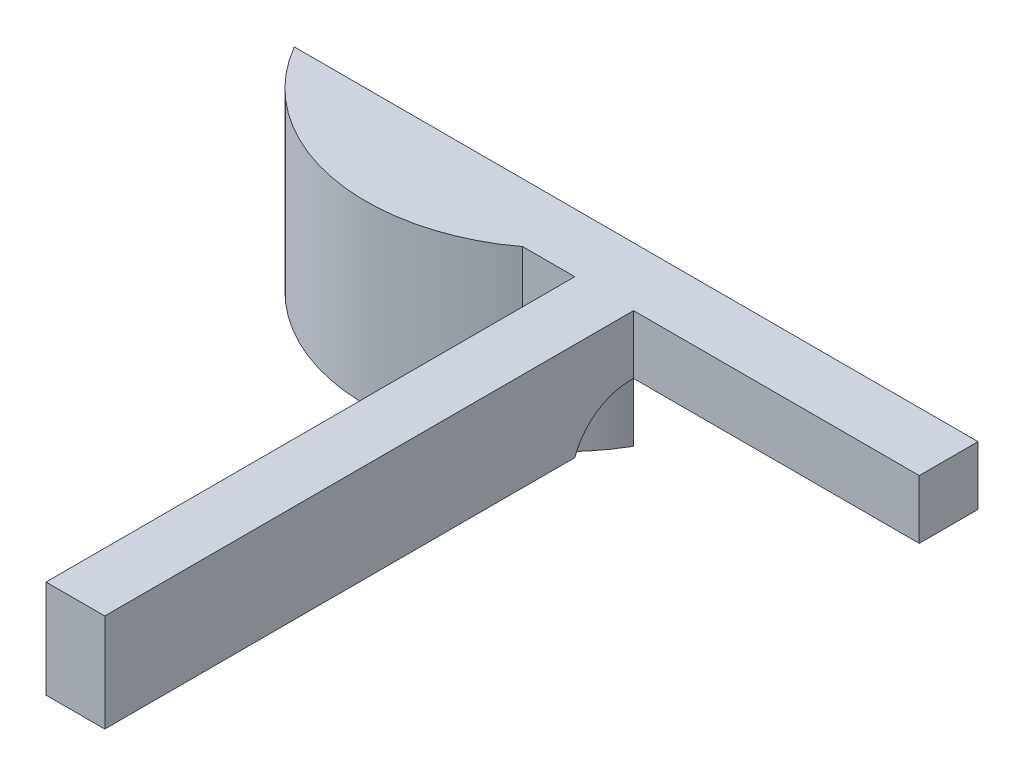
ISO-10303-21;
HEADER;
FILE_DESCRIPTION(('STEP AP214'),'2;1');
FILE_NAME('part.step','',(''),(''),'','','');
FILE_SCHEMA(('AUTOMOTIVE_DESIGN { 1 0 10303 214 1 1 1 1 }'));
ENDSEC;
DATA;
#1=APPLICATION_CONTEXT('core data for automotive mechanical design processes');
#2=APPLICATION_PROTOCOL_DEFINITION('international standard','automotive_design',2000,#1);
#3=PRODUCT_CONTEXT('',#1,'mechanical');
#4=PRODUCT('Part','Part','',(#3));
#5=PRODUCT_RELATED_PRODUCT_CATEGORY('part','',(#4));
#6=PRODUCT_DEFINITION_FORMATION('','',#4);
#7=PRODUCT_DEFINITION_CONTEXT('part definition',#1,'design');
#8=PRODUCT_DEFINITION('design','',#6,#7);
#9=PRODUCT_DEFINITION_SHAPE('','',#8);
#10=(LENGTH_UNIT() NAMED_UNIT(*) SI_UNIT(.MILLI.,.METRE.));
#11=(NAMED_UNIT(*) PLANE_ANGLE_UNIT() SI_UNIT($,.RADIAN.));
#12=(NAMED_UNIT(*) SI_UNIT($,.STERADIAN.) SOLID_ANGLE_UNIT());
#13=UNCERTAINTY_MEASURE_WITH_UNIT(LENGTH_MEASURE(1.E-05),#10,'distance_accuracy_value','');
#14=(GEOMETRIC_REPRESENTATION_CONTEXT(3) GLOBAL_UNCERTAINTY_ASSIGNED_CONTEXT((#13)) GLOBAL_UNIT_ASSIGNED_CONTEXT((#10,
#11,#12)) REPRESENTATION_CONTEXT('',''));
#15=CARTESIAN_POINT('',(0.,0.,0.));
#16=DIRECTION('',(0.,0.,1.));
#17=DIRECTION('',(1.,0.,0.));
#18=AXIS2_PLACEMENT_3D('',#15,#16,#17);
#19=CARTESIAN_POINT('',(0.,0.,0.));
#20=DIRECTION('',(0.,1.,0.));
#21=DIRECTION('',(0.,0.,1.));
#22=AXIS2_PLACEMENT_3D('',#19,#20,#21);
#23=PLANE('',#22);
#24=DIRECTION('',(0.,0.,-1.));
#25=VECTOR('',#24,1.);
#26=CARTESIAN_POINT('',(11.6602540378444,0.,35.));
#27=LINE('',#26,#25);
#28=CARTESIAN_POINT('',(11.6602540378444,0.,8.17060373191174));
#29=VERTEX_POINT('',#28);
#30=CARTESIAN_POINT('',(11.6602540378444,0.,8.));
#31=VERTEX_POINT('',#30);
#32=EDGE_CURVE('E229',#29,#31,#27,.T.);
#33=ORIENTED_EDGE('',*,*,#32,.F.);
#34=DIRECTION('',(1.,0.,0.));
#35=VECTOR('',#34,1.);
#36=CARTESIAN_POINT('',(0.,0.,8.17060373191174));
#37=LINE('',#36,#35);
#38=CARTESIAN_POINT('',(8.66025403784439,0.,8.17060373191174));
#39=VERTEX_POINT('',#38);
#40=EDGE_CURVE('E150',#29,#39,#37,.F.);
#41=ORIENTED_EDGE('',*,*,#40,.T.);
#42=DIRECTION('',(0.,0.,-1.));
#43=VECTOR('',#42,1.);
#44=CARTESIAN_POINT('',(8.66025403784439,0.,35.));
#45=LINE('',#44,#43);
#46=CARTESIAN_POINT('',(8.66025403784439,0.,8.));
#47=VERTEX_POINT('',#46);
#48=EDGE_CURVE('E246',#39,#47,#45,.T.);
#49=ORIENTED_EDGE('',*,*,#48,.T.);
#50=DIRECTION('',(1.,0.,0.));
#51=VECTOR('',#50,1.);
#52=CARTESIAN_POINT('',(0.,0.,8.));
#53=LINE('',#52,#51);
#54=CARTESIAN_POINT('',(7.54983443527075,0.,8.));
#55=VERTEX_POINT('',#54);
#56=EDGE_CURVE('E284',#55,#47,#53,.T.);
#57=ORIENTED_EDGE('',*,*,#56,.F.);
#58=CARTESIAN_POINT('',(0.,0.,0.));
#59=DIRECTION('',(0.,1.,0.));
#60=DIRECTION('',(0.,0.,1.));
#61=AXIS2_PLACEMENT_3D('',#58,#59,#60);
#62=CIRCLE('',#61,11.);
#63=CARTESIAN_POINT('',(9.79795897113271,0.,5.));
#64=VERTEX_POINT('',#63);
#65=EDGE_CURVE('E300',#55,#64,#62,.T.);
#66=ORIENTED_EDGE('',*,*,#65,.T.);
#67=DIRECTION('',(1.,0.,0.));
#68=VECTOR('',#67,1.);
#69=CARTESIAN_POINT('',(0.,0.,5.));
#70=LINE('',#69,#68);
#71=CARTESIAN_POINT('',(26.2449979983984,0.,5.));
#72=VERTEX_POINT('',#71);
#73=EDGE_CURVE('E268',#64,#72,#70,.T.);
#74=ORIENTED_EDGE('',*,*,#73,.T.);
#75=DIRECTION('',(0.,0.,-1.));
#76=VECTOR('',#75,1.);
#77=CARTESIAN_POINT('',(26.2449979983984,0.,0.));
#78=LINE('',#77,#76);
#79=CARTESIAN_POINT('',(26.2449979983984,0.,8.));
#80=VERTEX_POINT('',#79);
#81=EDGE_CURVE('E272',#80,#72,#78,.T.);
#82=ORIENTED_EDGE('',*,*,#81,.F.);
#83=EDGE_CURVE('E231',#31,#80,#53,.T.);
#84=ORIENTED_EDGE('',*,*,#83,.F.);
#85=EDGE_LOOP('',(#33,#41,#49,#57,#66,#74,#82,#84));
#86=FACE_BOUND('',#85,.T.);
#87=ADVANCED_FACE('F37',(#86),#23,.F.);
#88=CARTESIAN_POINT('',(0.,3.,8.));
#89=DIRECTION('',(0.,0.,-1.));
#90=DIRECTION('',(-1.,0.,0.));
#91=AXIS2_PLACEMENT_3D('',#88,#89,#90);
#92=PLANE('',#91);
#93=DIRECTION('',(1.,0.,0.));
#94=VECTOR('',#93,1.);
#95=CARTESIAN_POINT('',(0.,3.,8.));
#96=LINE('',#95,#94);
#97=CARTESIAN_POINT('',(11.6602540378444,3.,8.));
#98=VERTEX_POINT('',#97);
#99=CARTESIAN_POINT('',(26.2449979983984,3.,8.));
#100=VERTEX_POINT('',#99);
#101=EDGE_CURVE('E274',#98,#100,#96,.T.);
#102=ORIENTED_EDGE('',*,*,#101,.F.);
#103=DIRECTION('',(0.,-1.,0.));
#104=VECTOR('',#103,1.);
#105=CARTESIAN_POINT('',(11.6602540378444,3.,8.));
#106=LINE('',#105,#104);
#107=EDGE_CURVE('E237',#98,#31,#106,.T.);
#108=ORIENTED_EDGE('',*,*,#107,.T.);
#109=ORIENTED_EDGE('',*,*,#83,.T.);
#110=DIRECTION('',(0.,-1.,0.));
#111=VECTOR('',#110,1.);
#112=CARTESIAN_POINT('',(26.2449979983984,3.,8.));
#113=LINE('',#112,#111);
#114=EDGE_CURVE('E291',#100,#80,#113,.T.);
#115=ORIENTED_EDGE('',*,*,#114,.F.);
#116=EDGE_LOOP('',(#102,#108,#109,#115));
#117=FACE_BOUND('',#116,.T.);
#118=ADVANCED_FACE('F176',(#117),#92,.F.);
#119=CARTESIAN_POINT('',(0.,3.,5.));
#120=DIRECTION('',(0.,0.,-1.));
#121=DIRECTION('',(-1.,0.,0.));
#122=AXIS2_PLACEMENT_3D('',#119,#120,#121);
#123=PLANE('',#122);
#124=DIRECTION('',(1.,0.,0.));
#125=VECTOR('',#124,1.);
#126=CARTESIAN_POINT('',(0.,3.,5.));
#127=LINE('',#126,#125);
#128=CARTESIAN_POINT('',(-8.66025403784439,3.,5.));
#129=VERTEX_POINT('',#128);
#130=CARTESIAN_POINT('',(26.2449979983984,3.,5.));
#131=VERTEX_POINT('',#130);
#132=EDGE_CURVE('E269',#129,#131,#127,.T.);
#133=ORIENTED_EDGE('',*,*,#132,.T.);
#134=DIRECTION('',(0.,-1.,0.));
#135=VECTOR('',#134,1.);
#136=CARTESIAN_POINT('',(26.2449979983984,3.,5.));
#137=LINE('',#136,#135);
#138=EDGE_CURVE('E281',#131,#72,#137,.T.);
#139=ORIENTED_EDGE('',*,*,#138,.T.);
#140=ORIENTED_EDGE('',*,*,#73,.F.);
#141=CARTESIAN_POINT('',(9.79795897113271,0.,5.));
#142=CARTESIAN_POINT('',(9.72761682336962,1.10900954037672E-05,5.));
#143=CARTESIAN_POINT('',(9.65726465432284,-0.00588944403521871,5.));
#144=CARTESIAN_POINT('',(9.51832199870247,-0.029306070305392,5.));
#145=CARTESIAN_POINT('',(9.44973694478982,-0.0468543622165424,5.));
#146=CARTESIAN_POINT('',(9.31644513878141,-0.0933833926634255,5.));
#147=CARTESIAN_POINT('',(9.25174300025859,-0.122377432574764,5.));
#148=CARTESIAN_POINT('',(9.12854435340301,-0.191409865683067,5.));
#149=CARTESIAN_POINT('',(9.07004220803306,-0.231438105219946,5.));
#150=CARTESIAN_POINT('',(8.96470921988117,-0.319371859029543,5.));
#151=CARTESIAN_POINT('',(8.91740857349411,-0.366711505254911,5.));
#152=CARTESIAN_POINT('',(8.83286296179348,-0.469712138101888,5.));
#153=CARTESIAN_POINT('',(8.7956117236189,-0.525367899913306,5.));
#154=CARTESIAN_POINT('',(8.73760048523063,-0.635595652855344,5.));
#155=CARTESIAN_POINT('',(8.71532902210621,-0.689373539127373,5.));
#156=CARTESIAN_POINT('',(8.68162623541311,-0.800157472437469,5.));
#157=CARTESIAN_POINT('',(8.67016306938351,-0.857153509238941,5.));
#158=CARTESIAN_POINT('',(8.66306490404357,-0.928805889440061,5.));
#159=CARTESIAN_POINT('',(8.66201077469414,-0.943034000858278,5.));
#160=CARTESIAN_POINT('',(8.66060655289219,-0.971505826904159,5.));
#161=CARTESIAN_POINT('',(8.66025551830919,-0.985749495028477,5.));
#162=CARTESIAN_POINT('',(8.66025403784439,-1.,5.));
#163=B_SPLINE_CURVE_WITH_KNOTS('',3,(#141,#142,#143,#144,#145,#146,#147,#148,#149,#150,#151,
#152,#153,#154,#155,#156,#157,#158,#159,#160,#161,#162),.UNSPECIFIED.,.F.,.F.,(4,2,2,2,2,2,2,2,
2,2,4),(0.,0.210803800365691,0.422192800327881,0.633828187094118,0.845269473557663,
1.04488352876159,1.24437269464493,1.41801167636839,1.59113748479491,1.63392840147859,
1.67666194087572),.UNSPECIFIED.);
#164=CARTESIAN_POINT('',(8.66025403784439,-1.,5.));
#165=VERTEX_POINT('',#164);
#166=EDGE_CURVE('E153',#64,#165,#163,.T.);
#167=ORIENTED_EDGE('',*,*,#166,.T.);
#168=DIRECTION('',(0.,1.,0.));
#169=VECTOR('',#168,1.);
#170=CARTESIAN_POINT('',(8.66025403784439,-6.,5.));
#171=LINE('',#170,#169);
#172=CARTESIAN_POINT('',(8.66025403784439,-6.,5.));
#173=VERTEX_POINT('',#172);
#174=EDGE_CURVE('E263',#173,#165,#171,.T.);
#175=ORIENTED_EDGE('',*,*,#174,.F.);
#176=DIRECTION('',(1.,0.,0.));
#177=VECTOR('',#176,1.);
#178=CARTESIAN_POINT('',(0.,-6.,5.));
#179=LINE('',#178,#177);
#180=CARTESIAN_POINT('',(6.2449979983984,-6.,5.));
#181=VERTEX_POINT('',#180);
#182=EDGE_CURVE('E253',#181,#173,#179,.T.);
#183=ORIENTED_EDGE('',*,*,#182,.F.);
#184=DIRECTION('',(0.,1.,0.));
#185=VECTOR('',#184,1.);
#186=CARTESIAN_POINT('',(6.2449979983984,-6.,5.));
#187=LINE('',#186,#185);
#188=CARTESIAN_POINT('',(6.2449979983984,0.,5.));
#189=VERTEX_POINT('',#188);
#190=EDGE_CURVE('E266',#181,#189,#187,.T.);
#191=ORIENTED_EDGE('',*,*,#190,.T.);
#192=CARTESIAN_POINT('',(-6.2449979983984,0.,5.));
#193=VERTEX_POINT('',#192);
#194=EDGE_CURVE('E283',#193,#189,#70,.T.);
#195=ORIENTED_EDGE('',*,*,#194,.F.);
#196=DIRECTION('',(0.,1.,0.));
#197=VECTOR('',#196,1.);
#198=CARTESIAN_POINT('',(-6.2449979983984,-6.,5.));
#199=LINE('',#198,#197);
#200=CARTESIAN_POINT('',(-6.2449979983984,-6.,5.));
#201=VERTEX_POINT('',#200);
#202=EDGE_CURVE('E261',#201,#193,#199,.T.);
#203=ORIENTED_EDGE('',*,*,#202,.F.);
#204=CARTESIAN_POINT('',(-8.66025403784439,-6.,5.));
#205=VERTEX_POINT('',#204);
#206=EDGE_CURVE('E256',#205,#201,#179,.T.);
#207=ORIENTED_EDGE('',*,*,#206,.F.);
#208=DIRECTION('',(0.,-1.,0.));
#209=VECTOR('',#208,1.);
#210=CARTESIAN_POINT('',(-8.66025403784439,3.,5.));
#211=LINE('',#210,#209);
#212=EDGE_CURVE('E296',#129,#205,#211,.T.);
#213=ORIENTED_EDGE('',*,*,#212,.F.);
#214=EDGE_LOOP('',(#133,#139,#140,#167,#175,#183,#191,#195,#203,#207,#213));
#215=FACE_BOUND('',#214,.T.);
#216=ADVANCED_FACE('F171',(#215),#123,.T.);
#217=CARTESIAN_POINT('',(0.,3.,0.));
#218=DIRECTION('',(0.,-1.,0.));
#219=DIRECTION('',(0.,0.,-1.));
#220=AXIS2_PLACEMENT_3D('',#217,#218,#219);
#221=CYLINDRICAL_SURFACE('',#220,10.);
#222=ORIENTED_EDGE('',*,*,#174,.T.);
#223=CARTESIAN_POINT('',(0.,-1.,0.));
#224=DIRECTION('',(0.,1.,0.));
#225=DIRECTION('',(0.,0.,1.));
#226=AXIS2_PLACEMENT_3D('',#223,#224,#225);
#227=CIRCLE('',#226,10.);
#228=CARTESIAN_POINT('',(6.,-1.,8.));
#229=VERTEX_POINT('',#228);
#230=EDGE_CURVE('E298',#165,#229,#227,.F.);
#231=ORIENTED_EDGE('',*,*,#230,.T.);
#232=DIRECTION('',(0.,-1.,0.));
#233=VECTOR('',#232,1.);
#234=CARTESIAN_POINT('',(6.,3.,8.));
#235=LINE('',#234,#233);
#236=CARTESIAN_POINT('',(6.,3.,8.));
#237=VERTEX_POINT('',#236);
#238=EDGE_CURVE('E294',#237,#229,#235,.T.);
#239=ORIENTED_EDGE('',*,*,#238,.F.);
#240=CARTESIAN_POINT('',(0.,3.,0.));
#241=DIRECTION('',(0.,1.,0.));
#242=DIRECTION('',(0.,0.,1.));
#243=AXIS2_PLACEMENT_3D('',#240,#241,#242);
#244=CIRCLE('',#243,10.);
#245=EDGE_CURVE('E271',#129,#237,#244,.T.);
#246=ORIENTED_EDGE('',*,*,#245,.F.);
#247=ORIENTED_EDGE('',*,*,#212,.T.);
#248=CARTESIAN_POINT('',(0.,-6.,0.));
#249=DIRECTION('',(0.,-1.,0.));
#250=DIRECTION('',(0.,0.,-1.));
#251=AXIS2_PLACEMENT_3D('',#248,#249,#250);
#252=CIRCLE('',#251,10.);
#253=EDGE_CURVE('E255',#173,#205,#252,.T.);
#254=ORIENTED_EDGE('',*,*,#253,.F.);
#255=EDGE_LOOP('',(#222,#231,#239,#246,#247,#254));
#256=FACE_BOUND('',#255,.T.);
#257=ADVANCED_FACE('F175',(#256),#221,.T.);
#258=ORIENTED_EDGE('',*,*,#238,.T.);
#259=CARTESIAN_POINT('',(6.,-1.,8.));
#260=CARTESIAN_POINT('',(5.99999238106717,-0.979160469243082,8.));
#261=CARTESIAN_POINT('',(6.00108672592669,-0.958336985268452,8.));
#262=CARTESIAN_POINT('',(6.00540005287894,-0.916940070153584,8.));
#263=CARTESIAN_POINT('',(6.00861602595151,-0.896366326839907,8.));
#264=CARTESIAN_POINT('',(6.02121836424117,-0.835805930352294,8.));
#265=CARTESIAN_POINT('',(6.03356386132602,-0.796409380249933,8.));
#266=CARTESIAN_POINT('',(6.0648165995812,-0.720653688780115,8.));
#267=CARTESIAN_POINT('',(6.0836891807754,-0.684279737660445,8.));
#268=CARTESIAN_POINT('',(6.12664759807124,-0.614637567403576,8.));
#269=CARTESIAN_POINT('',(6.15075161139671,-0.58138077110921,8.));
#270=CARTESIAN_POINT('',(6.21832379965506,-0.499470084406747,8.));
#271=CARTESIAN_POINT('',(6.26481955912311,-0.453326086306723,8.));
#272=CARTESIAN_POINT('',(6.36432517664136,-0.368718068029987,8.));
#273=CARTESIAN_POINT('',(6.41735031535169,-0.330272638394648,8.));
#274=CARTESIAN_POINT('',(6.51512660974024,-0.268357463724322,8.));
#275=CARTESIAN_POINT('',(6.55899837690561,-0.243473330110714,8.));
#276=CARTESIAN_POINT('',(6.64872932260632,-0.197566411760472,8.));
#277=CARTESIAN_POINT('',(6.69458957385705,-0.176545744077271,8.));
#278=CARTESIAN_POINT('',(6.83450613394771,-0.118924001853227,8.));
#279=CARTESIAN_POINT('',(6.93085434572936,-0.0877898724868191,8.));
#280=CARTESIAN_POINT('',(7.11428090119226,-0.0424413237714773,8.));
#281=CARTESIAN_POINT('',(7.20096309016768,-0.0265688893099719,8.));
#282=CARTESIAN_POINT('',(7.33164284713813,-0.0106639341115777,8.));
#283=CARTESIAN_POINT('',(7.37518169765542,-0.00667979900545389,8.));
#284=CARTESIAN_POINT('',(7.46242173855252,-0.00134977989860445,8.));
#285=CARTESIAN_POINT('',(7.5061229345204,-3.98757075217262E-06,8.));
#286=CARTESIAN_POINT('',(7.54983443527075,0.,8.));
#287=B_SPLINE_CURVE_WITH_KNOTS('',3,(#259,#260,#261,#262,#263,#264,#265,#266,#267,#268,#269,
#270,#271,#272,#273,#274,#275,#276,#277,#278,#279,#280,#281,#282,#283,#284,#285,#286),
.UNSPECIFIED.,.F.,.F.,(4,2,2,2,2,2,2,2,2,2,2,2,2,4),(0.,0.0624604752143694,0.124832555136996,
0.247896010299234,0.3703157632255,0.493167889305729,0.688592769549646,0.884484018069612,
1.03559654568595,1.1867916327614,1.48933415664938,1.75307023702662,1.88416064954509,
2.01525561690074),.UNSPECIFIED.);
#288=EDGE_CURVE('E155',#229,#55,#287,.T.);
#289=ORIENTED_EDGE('',*,*,#288,.T.);
#290=ORIENTED_EDGE('',*,*,#56,.T.);
#291=DIRECTION('',(0.,1.,0.));
#292=VECTOR('',#291,1.);
#293=CARTESIAN_POINT('',(8.66025403784439,3.,8.));
#294=LINE('',#293,#292);
#295=CARTESIAN_POINT('',(8.66025403784439,3.,8.));
#296=VERTEX_POINT('',#295);
#297=EDGE_CURVE('E233',#47,#296,#294,.T.);
#298=ORIENTED_EDGE('',*,*,#297,.T.);
#299=EDGE_CURVE('E275',#237,#296,#96,.T.);
#300=ORIENTED_EDGE('',*,*,#299,.F.);
#301=EDGE_LOOP('',(#258,#289,#290,#298,#300));
#302=FACE_BOUND('',#301,.T.);
#303=ADVANCED_FACE('F179',(#302),#92,.F.);
#304=CARTESIAN_POINT('',(26.2449979983984,3.,0.));
#305=DIRECTION('',(-1.,0.,0.));
#306=DIRECTION('',(0.,0.,1.));
#307=AXIS2_PLACEMENT_3D('',#304,#305,#306);
#308=PLANE('',#307);
#309=ORIENTED_EDGE('',*,*,#81,.T.);
#310=ORIENTED_EDGE('',*,*,#138,.F.);
#311=DIRECTION('',(0.,0.,-1.));
#312=VECTOR('',#311,1.);
#313=CARTESIAN_POINT('',(26.2449979983984,3.,0.));
#314=LINE('',#313,#312);
#315=EDGE_CURVE('E278',#100,#131,#314,.T.);
#316=ORIENTED_EDGE('',*,*,#315,.F.);
#317=ORIENTED_EDGE('',*,*,#114,.T.);
#318=EDGE_LOOP('',(#309,#310,#316,#317));
#319=FACE_BOUND('',#318,.T.);
#320=ADVANCED_FACE('F184',(#319),#308,.F.);
#321=CARTESIAN_POINT('',(0.,3.,0.));
#322=DIRECTION('',(0.,1.,0.));
#323=DIRECTION('',(0.,0.,1.));
#324=AXIS2_PLACEMENT_3D('',#321,#322,#323);
#325=PLANE('',#324);
#326=ORIENTED_EDGE('',*,*,#299,.T.);
#327=DIRECTION('',(0.,0.,-1.));
#328=VECTOR('',#327,1.);
#329=CARTESIAN_POINT('',(8.66025403784439,3.,35.));
#330=LINE('',#329,#328);
#331=CARTESIAN_POINT('',(8.66025403784439,3.,35.));
#332=VERTEX_POINT('',#331);
#333=EDGE_CURVE('E240',#332,#296,#330,.T.);
#334=ORIENTED_EDGE('',*,*,#333,.F.);
#335=DIRECTION('',(1.,0.,0.));
#336=VECTOR('',#335,1.);
#337=CARTESIAN_POINT('',(0.,3.,35.));
#338=LINE('',#337,#336);
#339=CARTESIAN_POINT('',(11.6602540378444,3.,35.));
#340=VERTEX_POINT('',#339);
#341=EDGE_CURVE('E327',#332,#340,#338,.T.);
#342=ORIENTED_EDGE('',*,*,#341,.T.);
#343=DIRECTION('',(0.,0.,-1.));
#344=VECTOR('',#343,1.);
#345=CARTESIAN_POINT('',(11.6602540378444,3.,35.));
#346=LINE('',#345,#344);
#347=EDGE_CURVE('E234',#340,#98,#346,.T.);
#348=ORIENTED_EDGE('',*,*,#347,.T.);
#349=ORIENTED_EDGE('',*,*,#101,.T.);
#350=ORIENTED_EDGE('',*,*,#315,.T.);
#351=ORIENTED_EDGE('',*,*,#132,.F.);
#352=ORIENTED_EDGE('',*,*,#245,.T.);
#353=EDGE_LOOP('',(#326,#334,#342,#348,#349,#350,#351,#352));
#354=FACE_BOUND('',#353,.T.);
#355=ADVANCED_FACE('F188',(#354),#325,.T.);
#356=ORIENTED_EDGE('',*,*,#194,.T.);
#357=CARTESIAN_POINT('',(0.,0.,0.));
#358=DIRECTION('',(0.,-1.,0.));
#359=DIRECTION('',(0.,0.,-1.));
#360=AXIS2_PLACEMENT_3D('',#357,#358,#359);
#361=CIRCLE('',#360,8.);
#362=EDGE_CURVE('E249',#189,#193,#361,.T.);
#363=ORIENTED_EDGE('',*,*,#362,.T.);
#364=EDGE_LOOP('',(#356,#363));
#365=FACE_BOUND('',#364,.T.);
#366=ADVANCED_FACE('F190',(#365),#23,.F.);
#367=CARTESIAN_POINT('',(0.,-6.,0.));
#368=DIRECTION('',(0.,1.,0.));
#369=DIRECTION('',(0.,0.,1.));
#370=AXIS2_PLACEMENT_3D('',#367,#368,#369);
#371=CYLINDRICAL_SURFACE('',#370,8.);
#372=ORIENTED_EDGE('',*,*,#362,.F.);
#373=ORIENTED_EDGE('',*,*,#190,.F.);
#374=CARTESIAN_POINT('',(0.,-6.,0.));
#375=DIRECTION('',(0.,-1.,0.));
#376=DIRECTION('',(0.,0.,-1.));
#377=AXIS2_PLACEMENT_3D('',#374,#375,#376);
#378=CIRCLE('',#377,8.);
#379=EDGE_CURVE('E250',#181,#201,#378,.T.);
#380=ORIENTED_EDGE('',*,*,#379,.T.);
#381=ORIENTED_EDGE('',*,*,#202,.T.);
#382=EDGE_LOOP('',(#372,#373,#380,#381));
#383=FACE_BOUND('',#382,.T.);
#384=ADVANCED_FACE('F193',(#383),#371,.F.);
#385=CARTESIAN_POINT('',(0.,-6.,0.));
#386=DIRECTION('',(0.,-1.,0.));
#387=DIRECTION('',(0.,0.,-1.));
#388=AXIS2_PLACEMENT_3D('',#385,#386,#387);
#389=PLANE('',#388);
#390=ORIENTED_EDGE('',*,*,#379,.F.);
#391=ORIENTED_EDGE('',*,*,#182,.T.);
#392=ORIENTED_EDGE('',*,*,#253,.T.);
#393=ORIENTED_EDGE('',*,*,#206,.T.);
#394=EDGE_LOOP('',(#390,#391,#392,#393));
#395=FACE_BOUND('',#394,.T.);
#396=ADVANCED_FACE('F200',(#395),#389,.T.);
#397=CARTESIAN_POINT('',(11.6602540378444,0.,35.));
#398=DIRECTION('',(1.,0.,0.));
#399=DIRECTION('',(0.,1.,0.));
#400=AXIS2_PLACEMENT_3D('',#397,#398,#399);
#401=PLANE('',#400);
#402=ORIENTED_EDGE('',*,*,#107,.F.);
#403=ORIENTED_EDGE('',*,*,#347,.F.);
#404=DIRECTION('',(0.,-1.,0.));
#405=VECTOR('',#404,1.);
#406=CARTESIAN_POINT('',(11.6602540378444,0.,35.));
#407=LINE('',#406,#405);
#408=CARTESIAN_POINT('',(11.6602540378444,-2.00274538951765,35.));
#409=VERTEX_POINT('',#408);
#410=EDGE_CURVE('E138',#340,#409,#407,.T.);
#411=ORIENTED_EDGE('',*,*,#410,.T.);
#412=DIRECTION('',(0.,0.,1.));
#413=VECTOR('',#412,1.);
#414=CARTESIAN_POINT('',(11.6602540378444,-2.00274538951765,11.));
#415=LINE('',#414,#413);
#416=CARTESIAN_POINT('',(11.6602540378444,-2.00274538951765,11.));
#417=VERTEX_POINT('',#416);
#418=EDGE_CURVE('E134',#417,#409,#415,.T.);
#419=ORIENTED_EDGE('',*,*,#418,.F.);
#420=CARTESIAN_POINT('',(11.6602540378444,-3.,8.17060373191174));
#421=DIRECTION('',(1.,0.,0.));
#422=DIRECTION('',(0.,1.,0.));
#423=AXIS2_PLACEMENT_3D('',#420,#421,#422);
#424=CIRCLE('',#423,3.);
#425=EDGE_CURVE('E11',#417,#29,#424,.F.);
#426=ORIENTED_EDGE('',*,*,#425,.T.);
#427=ORIENTED_EDGE('',*,*,#32,.T.);
#428=EDGE_LOOP('',(#402,#403,#411,#419,#426,#427));
#429=FACE_BOUND('',#428,.T.);
#430=ADVANCED_FACE('F136',(#429),#401,.T.);
#431=CARTESIAN_POINT('',(8.66025403784439,0.,35.));
#432=DIRECTION('',(-1.,0.,0.));
#433=DIRECTION('',(0.,0.,1.));
#434=AXIS2_PLACEMENT_3D('',#431,#432,#433);
#435=PLANE('',#434);
#436=ORIENTED_EDGE('',*,*,#297,.F.);
#437=ORIENTED_EDGE('',*,*,#48,.F.);
#438=CARTESIAN_POINT('',(8.66025403784439,-3.,8.17060373191174));
#439=DIRECTION('',(-1.,0.,0.));
#440=DIRECTION('',(0.,0.,1.));
#441=AXIS2_PLACEMENT_3D('',#438,#439,#440);
#442=CIRCLE('',#441,3.);
#443=CARTESIAN_POINT('',(8.66025403784439,-2.00274538951765,11.));
#444=VERTEX_POINT('',#443);
#445=EDGE_CURVE('E45',#39,#444,#442,.F.);
#446=ORIENTED_EDGE('',*,*,#445,.T.);
#447=DIRECTION('',(0.,0.,1.));
#448=VECTOR('',#447,1.);
#449=CARTESIAN_POINT('',(8.66025403784439,-2.00274538951765,11.));
#450=LINE('',#449,#448);
#451=CARTESIAN_POINT('',(8.66025403784439,-2.00274538951765,35.));
#452=VERTEX_POINT('',#451);
#453=EDGE_CURVE('E142',#444,#452,#450,.T.);
#454=ORIENTED_EDGE('',*,*,#453,.T.);
#455=DIRECTION('',(0.,1.,0.));
#456=VECTOR('',#455,1.);
#457=CARTESIAN_POINT('',(8.66025403784439,0.,35.));
#458=LINE('',#457,#456);
#459=EDGE_CURVE('E329',#452,#332,#458,.T.);
#460=ORIENTED_EDGE('',*,*,#459,.T.);
#461=ORIENTED_EDGE('',*,*,#333,.T.);
#462=EDGE_LOOP('',(#436,#437,#446,#454,#460,#461));
#463=FACE_BOUND('',#462,.T.);
#464=ADVANCED_FACE('F205',(#463),#435,.T.);
#465=CARTESIAN_POINT('',(0.,0.,35.));
#466=DIRECTION('',(0.,0.,-1.));
#467=DIRECTION('',(-1.,0.,0.));
#468=AXIS2_PLACEMENT_3D('',#465,#466,#467);
#469=PLANE('',#468);
#470=ORIENTED_EDGE('',*,*,#459,.F.);
#471=DIRECTION('',(1.,0.,0.));
#472=VECTOR('',#471,1.);
#473=CARTESIAN_POINT('',(8.66025403784439,-2.00274538951765,35.));
#474=LINE('',#473,#472);
#475=EDGE_CURVE('E148',#452,#409,#474,.T.);
#476=ORIENTED_EDGE('',*,*,#475,.T.);
#477=ORIENTED_EDGE('',*,*,#410,.F.);
#478=ORIENTED_EDGE('',*,*,#341,.F.);
#479=EDGE_LOOP('',(#470,#476,#477,#478));
#480=FACE_BOUND('',#479,.T.);
#481=ADVANCED_FACE('F208',(#480),#469,.F.);
#482=CARTESIAN_POINT('',(0.,-1.,0.));
#483=DIRECTION('',(0.,1.,0.));
#484=DIRECTION('',(0.,0.,1.));
#485=AXIS2_PLACEMENT_3D('',#482,#483,#484);
#486=TOROIDAL_SURFACE('',#485,11.,1.);
#487=ORIENTED_EDGE('',*,*,#166,.F.);
#488=ORIENTED_EDGE('',*,*,#65,.F.);
#489=ORIENTED_EDGE('',*,*,#288,.F.);
#490=ORIENTED_EDGE('',*,*,#230,.F.);
#491=EDGE_LOOP('',(#487,#488,#489,#490));
#492=FACE_BOUND('',#491,.T.);
#493=ADVANCED_FACE('F169',(#492),#486,.F.);
#494=CARTESIAN_POINT('',(8.66025403784439,-2.00274538951765,11.));
#495=DIRECTION('',(0.,-1.,0.));
#496=DIRECTION('',(1.,0.,0.));
#497=AXIS2_PLACEMENT_3D('',#494,#495,#496);
#498=PLANE('',#497);
#499=ORIENTED_EDGE('',*,*,#475,.F.);
#500=ORIENTED_EDGE('',*,*,#453,.F.);
#501=DIRECTION('',(1.,0.,0.));
#502=VECTOR('',#501,1.);
#503=CARTESIAN_POINT('',(8.66025403784439,-2.00274538951765,11.));
#504=LINE('',#503,#502);
#505=EDGE_CURVE('E143',#444,#417,#504,.T.);
#506=ORIENTED_EDGE('',*,*,#505,.T.);
#507=ORIENTED_EDGE('',*,*,#418,.T.);
#508=EDGE_LOOP('',(#499,#500,#506,#507));
#509=FACE_BOUND('',#508,.T.);
#510=ADVANCED_FACE('F146',(#509),#498,.T.);
#511=CARTESIAN_POINT('',(0.,-3.,8.17060373191174));
#512=DIRECTION('',(1.,0.,0.));
#513=DIRECTION('',(0.,1.,0.));
#514=AXIS2_PLACEMENT_3D('',#511,#512,#513);
#515=CYLINDRICAL_SURFACE('',#514,3.);
#516=ORIENTED_EDGE('',*,*,#425,.F.);
#517=ORIENTED_EDGE('',*,*,#505,.F.);
#518=ORIENTED_EDGE('',*,*,#445,.F.);
#519=ORIENTED_EDGE('',*,*,#40,.F.);
#520=EDGE_LOOP('',(#516,#517,#518,#519));
#521=FACE_BOUND('',#520,.T.);
#522=ADVANCED_FACE('F39',(#521),#515,.F.);
#523=CLOSED_SHELL('',(#87,#118,#216,#257,#303,#320,#355,#366,#384,#396,#430,#464,#481,#493,#510,#522));
#524=MANIFOLD_SOLID_BREP('B2',#523);
#525=ADVANCED_BREP_SHAPE_REPRESENTATION('',(#18,#524),#14);
#526=SHAPE_DEFINITION_REPRESENTATION(#9,#525);
ENDSEC;
END-ISO-10303-21;
